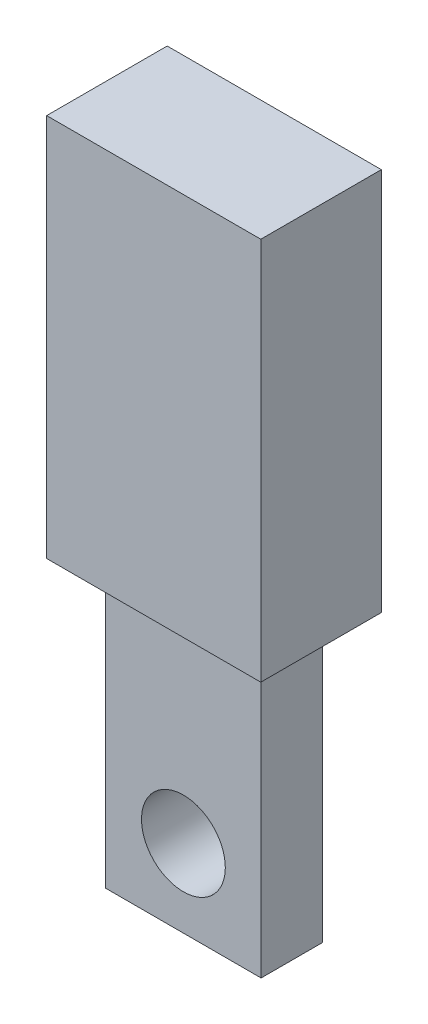
ISO-10303-21;
HEADER;
FILE_DESCRIPTION(('STEP AP214'),'2;1');
FILE_NAME('part.step','',(''),(''),'','','');
FILE_SCHEMA(('AUTOMOTIVE_DESIGN { 1 0 10303 214 1 1 1 1 }'));
ENDSEC;
DATA;
#1=APPLICATION_CONTEXT('core data for automotive mechanical design processes');
#2=APPLICATION_PROTOCOL_DEFINITION('international standard','automotive_design',2000,#1);
#3=PRODUCT_CONTEXT('',#1,'mechanical');
#4=PRODUCT('Part','Part','',(#3));
#5=PRODUCT_RELATED_PRODUCT_CATEGORY('part','',(#4));
#6=PRODUCT_DEFINITION_FORMATION('','',#4);
#7=PRODUCT_DEFINITION_CONTEXT('part definition',#1,'design');
#8=PRODUCT_DEFINITION('design','',#6,#7);
#9=PRODUCT_DEFINITION_SHAPE('','',#8);
#10=(LENGTH_UNIT() NAMED_UNIT(*) SI_UNIT(.MILLI.,.METRE.));
#11=(NAMED_UNIT(*) PLANE_ANGLE_UNIT() SI_UNIT($,.RADIAN.));
#12=(NAMED_UNIT(*) SI_UNIT($,.STERADIAN.) SOLID_ANGLE_UNIT());
#13=UNCERTAINTY_MEASURE_WITH_UNIT(LENGTH_MEASURE(1.E-05),#10,'distance_accuracy_value','');
#14=(GEOMETRIC_REPRESENTATION_CONTEXT(3) GLOBAL_UNCERTAINTY_ASSIGNED_CONTEXT((#13)) GLOBAL_UNIT_ASSIGNED_CONTEXT((#10,
#11,#12)) REPRESENTATION_CONTEXT('',''));
#15=CARTESIAN_POINT('',(0.,0.,0.));
#16=DIRECTION('',(0.,0.,1.));
#17=DIRECTION('',(1.,0.,0.));
#18=AXIS2_PLACEMENT_3D('',#15,#16,#17);
#19=CARTESIAN_POINT('',(-32.258,-59.309,-12.7));
#20=DIRECTION('',(-1.,0.,0.));
#21=DIRECTION('',(0.,0.,1.));
#22=AXIS2_PLACEMENT_3D('',#19,#20,#21);
#23=PLANE('',#22);
#24=DIRECTION('',(0.,1.,0.));
#25=VECTOR('',#24,1.);
#26=CARTESIAN_POINT('',(-32.258,-59.309,12.7));
#27=LINE('',#26,#25);
#28=CARTESIAN_POINT('',(-32.258,-59.309,12.7));
#29=VERTEX_POINT('',#28);
#30=CARTESIAN_POINT('',(-32.258,59.309,12.7));
#31=VERTEX_POINT('',#30);
#32=EDGE_CURVE('E37',#29,#31,#27,.T.);
#33=ORIENTED_EDGE('',*,*,#32,.T.);
#34=DIRECTION('',(0.,0.,1.));
#35=VECTOR('',#34,1.);
#36=CARTESIAN_POINT('',(-32.258,59.309,-12.7));
#37=LINE('',#36,#35);
#38=CARTESIAN_POINT('',(-32.258,59.309,-12.7));
#39=VERTEX_POINT('',#38);
#40=EDGE_CURVE('E135',#39,#31,#37,.T.);
#41=ORIENTED_EDGE('',*,*,#40,.F.);
#42=DIRECTION('',(0.,1.,0.));
#43=VECTOR('',#42,1.);
#44=CARTESIAN_POINT('',(-32.258,-59.309,-12.7));
#45=LINE('',#44,#43);
#46=CARTESIAN_POINT('',(-32.258,-59.309,-12.7));
#47=VERTEX_POINT('',#46);
#48=EDGE_CURVE('E11',#47,#39,#45,.T.);
#49=ORIENTED_EDGE('',*,*,#48,.F.);
#50=DIRECTION('',(0.,0.,1.));
#51=VECTOR('',#50,1.);
#52=CARTESIAN_POINT('',(-32.258,-59.309,-12.7));
#53=LINE('',#52,#51);
#54=EDGE_CURVE('E147',#47,#29,#53,.T.);
#55=ORIENTED_EDGE('',*,*,#54,.T.);
#56=EDGE_LOOP('',(#33,#41,#49,#55));
#57=FACE_BOUND('',#56,.T.);
#58=ADVANCED_FACE('F34',(#57),#23,.T.);
#59=CARTESIAN_POINT('',(-32.258,-59.309,-12.7));
#60=DIRECTION('',(0.,0.,-1.));
#61=DIRECTION('',(-1.,0.,0.));
#62=AXIS2_PLACEMENT_3D('',#59,#60,#61);
#63=PLANE('',#62);
#64=CARTESIAN_POINT('',(0.,-27.051,-12.7));
#65=DIRECTION('',(0.,0.,1.));
#66=DIRECTION('',(1.,0.,0.));
#67=AXIS2_PLACEMENT_3D('',#64,#65,#66);
#68=CIRCLE('',#67,17.399);
#69=CARTESIAN_POINT('',(17.399,-27.051,-12.7));
#70=VERTEX_POINT('',#69);
#71=EDGE_CURVE('E127',#70,#70,#68,.T.);
#72=ORIENTED_EDGE('',*,*,#71,.T.);
#73=EDGE_LOOP('',(#72));
#74=FACE_BOUND('',#73,.T.);
#75=ORIENTED_EDGE('',*,*,#48,.T.);
#76=DIRECTION('',(-1.,0.,0.));
#77=VECTOR('',#76,1.);
#78=CARTESIAN_POINT('',(-32.258,59.309,-12.7));
#79=LINE('',#78,#77);
#80=CARTESIAN_POINT('',(32.258,59.309,-12.7));
#81=VERTEX_POINT('',#80);
#82=EDGE_CURVE('E144',#81,#39,#79,.T.);
#83=ORIENTED_EDGE('',*,*,#82,.F.);
#84=DIRECTION('',(0.,1.,0.));
#85=VECTOR('',#84,1.);
#86=CARTESIAN_POINT('',(32.258,-59.309,-12.7));
#87=LINE('',#86,#85);
#88=CARTESIAN_POINT('',(32.258,-59.309,-12.7));
#89=VERTEX_POINT('',#88);
#90=EDGE_CURVE('E42',#89,#81,#87,.T.);
#91=ORIENTED_EDGE('',*,*,#90,.F.);
#92=DIRECTION('',(-1.,0.,0.));
#93=VECTOR('',#92,1.);
#94=CARTESIAN_POINT('',(-32.258,-59.309,-12.7));
#95=LINE('',#94,#93);
#96=EDGE_CURVE('E154',#89,#47,#95,.T.);
#97=ORIENTED_EDGE('',*,*,#96,.T.);
#98=EDGE_LOOP('',(#75,#83,#91,#97));
#99=FACE_BOUND('',#98,.T.);
#100=ADVANCED_FACE('F165',(#74,#99),#63,.T.);
#101=CARTESIAN_POINT('',(32.258,-59.309,-12.7));
#102=DIRECTION('',(1.,0.,0.));
#103=DIRECTION('',(0.,0.,-1.));
#104=AXIS2_PLACEMENT_3D('',#101,#102,#103);
#105=PLANE('',#104);
#106=ORIENTED_EDGE('',*,*,#90,.T.);
#107=DIRECTION('',(0.,0.,-1.));
#108=VECTOR('',#107,1.);
#109=CARTESIAN_POINT('',(32.258,59.309,-12.7));
#110=LINE('',#109,#108);
#111=CARTESIAN_POINT('',(32.258,59.309,12.7));
#112=VERTEX_POINT('',#111);
#113=EDGE_CURVE('E141',#112,#81,#110,.T.);
#114=ORIENTED_EDGE('',*,*,#113,.F.);
#115=DIRECTION('',(0.,1.,0.));
#116=VECTOR('',#115,1.);
#117=CARTESIAN_POINT('',(32.258,-59.309,12.7));
#118=LINE('',#117,#116);
#119=CARTESIAN_POINT('',(32.258,-59.309,12.7));
#120=VERTEX_POINT('',#119);
#121=EDGE_CURVE('E156',#120,#112,#118,.T.);
#122=ORIENTED_EDGE('',*,*,#121,.F.);
#123=DIRECTION('',(0.,0.,-1.));
#124=VECTOR('',#123,1.);
#125=CARTESIAN_POINT('',(32.258,-59.309,-12.7));
#126=LINE('',#125,#124);
#127=EDGE_CURVE('E152',#120,#89,#126,.T.);
#128=ORIENTED_EDGE('',*,*,#127,.T.);
#129=EDGE_LOOP('',(#106,#114,#122,#128));
#130=FACE_BOUND('',#129,.T.);
#131=ADVANCED_FACE('F171',(#130),#105,.T.);
#132=CARTESIAN_POINT('',(-32.258,-59.309,12.7));
#133=DIRECTION('',(0.,0.,1.));
#134=DIRECTION('',(1.,0.,0.));
#135=AXIS2_PLACEMENT_3D('',#132,#133,#134);
#136=PLANE('',#135);
#137=CARTESIAN_POINT('',(0.,-27.051,12.7));
#138=DIRECTION('',(0.,0.,1.));
#139=DIRECTION('',(1.,0.,0.));
#140=AXIS2_PLACEMENT_3D('',#137,#138,#139);
#141=CIRCLE('',#140,17.399);
#142=CARTESIAN_POINT('',(17.399,-27.051,12.7));
#143=VERTEX_POINT('',#142);
#144=EDGE_CURVE('E124',#143,#143,#141,.T.);
#145=ORIENTED_EDGE('',*,*,#144,.F.);
#146=EDGE_LOOP('',(#145));
#147=FACE_BOUND('',#146,.T.);
#148=ORIENTED_EDGE('',*,*,#121,.T.);
#149=DIRECTION('',(1.,0.,0.));
#150=VECTOR('',#149,1.);
#151=CARTESIAN_POINT('',(-32.258,59.309,12.7));
#152=LINE('',#151,#150);
#153=EDGE_CURVE('E138',#31,#112,#152,.T.);
#154=ORIENTED_EDGE('',*,*,#153,.F.);
#155=ORIENTED_EDGE('',*,*,#32,.F.);
#156=DIRECTION('',(1.,0.,0.));
#157=VECTOR('',#156,1.);
#158=CARTESIAN_POINT('',(-32.258,-59.309,12.7));
#159=LINE('',#158,#157);
#160=EDGE_CURVE('E149',#29,#120,#159,.T.);
#161=ORIENTED_EDGE('',*,*,#160,.T.);
#162=EDGE_LOOP('',(#148,#154,#155,#161));
#163=FACE_BOUND('',#162,.T.);
#164=ADVANCED_FACE('F161',(#147,#163),#136,.T.);
#165=CARTESIAN_POINT('',(-32.258,-59.309,12.7));
#166=DIRECTION('',(0.,1.,0.));
#167=DIRECTION('',(0.,0.,1.));
#168=AXIS2_PLACEMENT_3D('',#165,#166,#167);
#169=PLANE('',#168);
#170=ORIENTED_EDGE('',*,*,#54,.F.);
#171=ORIENTED_EDGE('',*,*,#96,.F.);
#172=ORIENTED_EDGE('',*,*,#127,.F.);
#173=ORIENTED_EDGE('',*,*,#160,.F.);
#174=EDGE_LOOP('',(#170,#171,#172,#173));
#175=FACE_BOUND('',#174,.T.);
#176=ADVANCED_FACE('F169',(#175),#169,.F.);
#177=CARTESIAN_POINT('',(0.,-27.051,-12.7));
#178=DIRECTION('',(0.,0.,1.));
#179=DIRECTION('',(1.,0.,0.));
#180=AXIS2_PLACEMENT_3D('',#177,#178,#179);
#181=CYLINDRICAL_SURFACE('',#180,17.399);
#182=ORIENTED_EDGE('',*,*,#71,.F.);
#183=EDGE_LOOP('',(#182));
#184=FACE_BOUND('',#183,.T.);
#185=ORIENTED_EDGE('',*,*,#144,.T.);
#186=EDGE_LOOP('',(#185));
#187=FACE_BOUND('',#186,.T.);
#188=ADVANCED_FACE('F210',(#184,#187),#181,.F.);
#189=CARTESIAN_POINT('',(44.45,218.567,25.019));
#190=DIRECTION('',(-1.,0.,0.));
#191=DIRECTION('',(0.,0.,1.));
#192=AXIS2_PLACEMENT_3D('',#189,#190,#191);
#193=PLANE('',#192);
#194=DIRECTION('',(0.,0.,-1.));
#195=VECTOR('',#194,1.);
#196=CARTESIAN_POINT('',(44.45,59.309,25.019));
#197=LINE('',#196,#195);
#198=CARTESIAN_POINT('',(44.45,59.309,25.019));
#199=VERTEX_POINT('',#198);
#200=CARTESIAN_POINT('',(44.45,59.309,-25.019));
#201=VERTEX_POINT('',#200);
#202=EDGE_CURVE('E123',#199,#201,#197,.T.);
#203=ORIENTED_EDGE('',*,*,#202,.T.);
#204=DIRECTION('',(0.,-1.,0.));
#205=VECTOR('',#204,1.);
#206=CARTESIAN_POINT('',(44.45,218.567,-25.019));
#207=LINE('',#206,#205);
#208=CARTESIAN_POINT('',(44.45,218.567,-25.019));
#209=VERTEX_POINT('',#208);
#210=EDGE_CURVE('E103',#209,#201,#207,.T.);
#211=ORIENTED_EDGE('',*,*,#210,.F.);
#212=DIRECTION('',(0.,0.,-1.));
#213=VECTOR('',#212,1.);
#214=CARTESIAN_POINT('',(44.45,218.567,25.019));
#215=LINE('',#214,#213);
#216=CARTESIAN_POINT('',(44.45,218.567,25.019));
#217=VERTEX_POINT('',#216);
#218=EDGE_CURVE('E110',#217,#209,#215,.T.);
#219=ORIENTED_EDGE('',*,*,#218,.F.);
#220=DIRECTION('',(0.,-1.,0.));
#221=VECTOR('',#220,1.);
#222=CARTESIAN_POINT('',(44.45,218.567,25.019));
#223=LINE('',#222,#221);
#224=EDGE_CURVE('E277',#217,#199,#223,.T.);
#225=ORIENTED_EDGE('',*,*,#224,.T.);
#226=EDGE_LOOP('',(#203,#211,#219,#225));
#227=FACE_BOUND('',#226,.T.);
#228=ADVANCED_FACE('F121',(#227),#193,.F.);
#229=CARTESIAN_POINT('',(44.45,218.567,-25.019));
#230=DIRECTION('',(0.,0.,1.));
#231=DIRECTION('',(1.,0.,0.));
#232=AXIS2_PLACEMENT_3D('',#229,#230,#231);
#233=PLANE('',#232);
#234=DIRECTION('',(-1.,0.,0.));
#235=VECTOR('',#234,1.);
#236=CARTESIAN_POINT('',(44.45,59.309,-25.019));
#237=LINE('',#236,#235);
#238=CARTESIAN_POINT('',(-44.45,59.309,-25.019));
#239=VERTEX_POINT('',#238);
#240=EDGE_CURVE('E283',#201,#239,#237,.T.);
#241=ORIENTED_EDGE('',*,*,#240,.T.);
#242=DIRECTION('',(0.,-1.,0.));
#243=VECTOR('',#242,1.);
#244=CARTESIAN_POINT('',(-44.45,218.567,-25.019));
#245=LINE('',#244,#243);
#246=CARTESIAN_POINT('',(-44.45,218.567,-25.019));
#247=VERTEX_POINT('',#246);
#248=EDGE_CURVE('E106',#247,#239,#245,.T.);
#249=ORIENTED_EDGE('',*,*,#248,.F.);
#250=DIRECTION('',(-1.,0.,0.));
#251=VECTOR('',#250,1.);
#252=CARTESIAN_POINT('',(44.45,218.567,-25.019));
#253=LINE('',#252,#251);
#254=EDGE_CURVE('E99',#209,#247,#253,.T.);
#255=ORIENTED_EDGE('',*,*,#254,.F.);
#256=ORIENTED_EDGE('',*,*,#210,.T.);
#257=EDGE_LOOP('',(#241,#249,#255,#256));
#258=FACE_BOUND('',#257,.T.);
#259=ADVANCED_FACE('F101',(#258),#233,.F.);
#260=CARTESIAN_POINT('',(-44.45,218.567,25.019));
#261=DIRECTION('',(1.,0.,0.));
#262=DIRECTION('',(0.,0.,-1.));
#263=AXIS2_PLACEMENT_3D('',#260,#261,#262);
#264=PLANE('',#263);
#265=DIRECTION('',(0.,0.,1.));
#266=VECTOR('',#265,1.);
#267=CARTESIAN_POINT('',(-44.45,59.309,25.019));
#268=LINE('',#267,#266);
#269=CARTESIAN_POINT('',(-44.45,59.309,25.019));
#270=VERTEX_POINT('',#269);
#271=EDGE_CURVE('E280',#239,#270,#268,.T.);
#272=ORIENTED_EDGE('',*,*,#271,.T.);
#273=DIRECTION('',(0.,-1.,0.));
#274=VECTOR('',#273,1.);
#275=CARTESIAN_POINT('',(-44.45,218.567,25.019));
#276=LINE('',#275,#274);
#277=CARTESIAN_POINT('',(-44.45,218.567,25.019));
#278=VERTEX_POINT('',#277);
#279=EDGE_CURVE('E129',#278,#270,#276,.T.);
#280=ORIENTED_EDGE('',*,*,#279,.F.);
#281=DIRECTION('',(0.,0.,1.));
#282=VECTOR('',#281,1.);
#283=CARTESIAN_POINT('',(-44.45,218.567,25.019));
#284=LINE('',#283,#282);
#285=EDGE_CURVE('E109',#247,#278,#284,.T.);
#286=ORIENTED_EDGE('',*,*,#285,.F.);
#287=ORIENTED_EDGE('',*,*,#248,.T.);
#288=EDGE_LOOP('',(#272,#280,#286,#287));
#289=FACE_BOUND('',#288,.T.);
#290=ADVANCED_FACE('F221',(#289),#264,.F.);
#291=CARTESIAN_POINT('',(44.45,218.567,25.019));
#292=DIRECTION('',(0.,0.,-1.));
#293=DIRECTION('',(-1.,0.,0.));
#294=AXIS2_PLACEMENT_3D('',#291,#292,#293);
#295=PLANE('',#294);
#296=DIRECTION('',(1.,0.,0.));
#297=VECTOR('',#296,1.);
#298=CARTESIAN_POINT('',(44.45,59.309,25.019));
#299=LINE('',#298,#297);
#300=EDGE_CURVE('E119',#270,#199,#299,.T.);
#301=ORIENTED_EDGE('',*,*,#300,.T.);
#302=ORIENTED_EDGE('',*,*,#224,.F.);
#303=DIRECTION('',(1.,0.,0.));
#304=VECTOR('',#303,1.);
#305=CARTESIAN_POINT('',(44.45,218.567,25.019));
#306=LINE('',#305,#304);
#307=EDGE_CURVE('E115',#278,#217,#306,.T.);
#308=ORIENTED_EDGE('',*,*,#307,.F.);
#309=ORIENTED_EDGE('',*,*,#279,.T.);
#310=EDGE_LOOP('',(#301,#302,#308,#309));
#311=FACE_BOUND('',#310,.T.);
#312=ADVANCED_FACE('F230',(#311),#295,.F.);
#313=CARTESIAN_POINT('',(44.45,218.567,-25.019));
#314=DIRECTION('',(0.,1.,0.));
#315=DIRECTION('',(0.,0.,1.));
#316=AXIS2_PLACEMENT_3D('',#313,#314,#315);
#317=PLANE('',#316);
#318=ORIENTED_EDGE('',*,*,#218,.T.);
#319=ORIENTED_EDGE('',*,*,#254,.T.);
#320=ORIENTED_EDGE('',*,*,#285,.T.);
#321=ORIENTED_EDGE('',*,*,#307,.T.);
#322=EDGE_LOOP('',(#318,#319,#320,#321));
#323=FACE_BOUND('',#322,.T.);
#324=ADVANCED_FACE('F113',(#323),#317,.T.);
#325=CARTESIAN_POINT('',(44.45,59.309,-25.019));
#326=DIRECTION('',(0.,1.,0.));
#327=DIRECTION('',(0.,0.,1.));
#328=AXIS2_PLACEMENT_3D('',#325,#326,#327);
#329=PLANE('',#328);
#330=ORIENTED_EDGE('',*,*,#40,.T.);
#331=ORIENTED_EDGE('',*,*,#153,.T.);
#332=ORIENTED_EDGE('',*,*,#113,.T.);
#333=ORIENTED_EDGE('',*,*,#82,.T.);
#334=EDGE_LOOP('',(#330,#331,#332,#333));
#335=FACE_BOUND('',#334,.T.);
#336=ORIENTED_EDGE('',*,*,#202,.F.);
#337=ORIENTED_EDGE('',*,*,#300,.F.);
#338=ORIENTED_EDGE('',*,*,#271,.F.);
#339=ORIENTED_EDGE('',*,*,#240,.F.);
#340=EDGE_LOOP('',(#336,#337,#338,#339));
#341=FACE_BOUND('',#340,.T.);
#342=ADVANCED_FACE('F163',(#335,#341),#329,.F.);
#343=CLOSED_SHELL('',(#58,#100,#131,#164,#176,#188,#228,#259,#290,#312,#324,#342));
#344=MANIFOLD_SOLID_BREP('B2',#343);
#345=ADVANCED_BREP_SHAPE_REPRESENTATION('',(#18,#344),#14);
#346=SHAPE_DEFINITION_REPRESENTATION(#9,#345);
ENDSEC;
END-ISO-10303-21;
